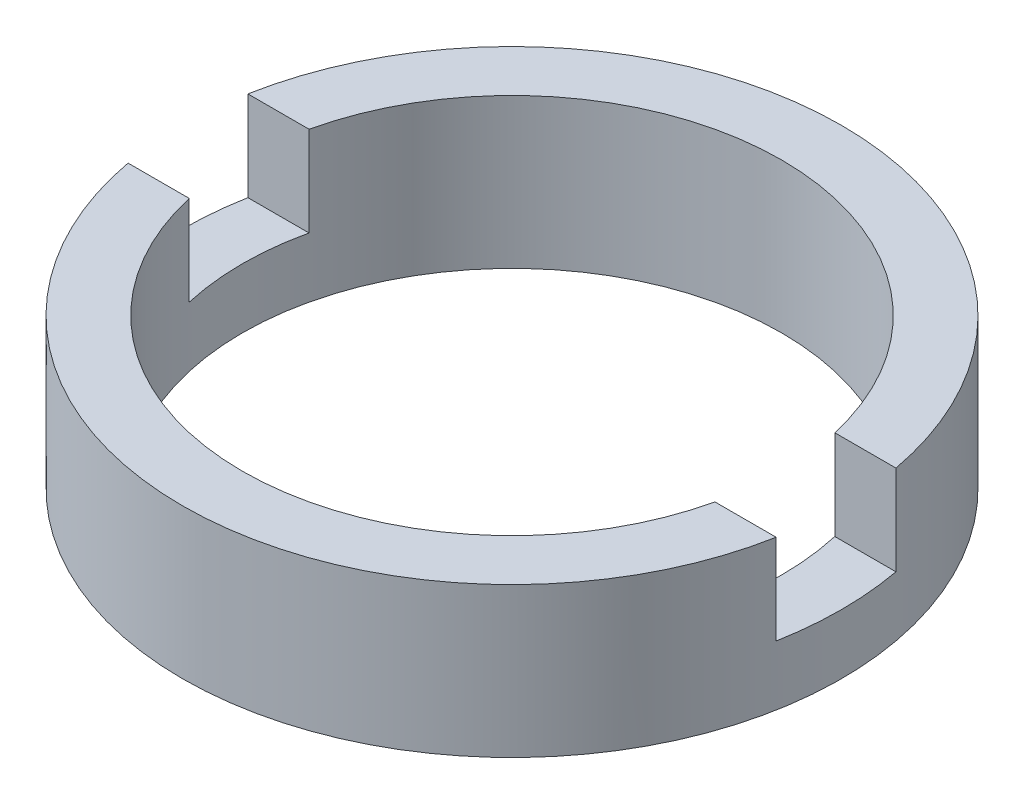
ISO-10303-21;
HEADER;
FILE_DESCRIPTION(('STEP AP214'),'2;1');
FILE_NAME('part.step','',(''),(''),'','','');
FILE_SCHEMA(('AUTOMOTIVE_DESIGN { 1 0 10303 214 1 1 1 1 }'));
ENDSEC;
DATA;
#1=APPLICATION_CONTEXT('core data for automotive mechanical design processes');
#2=APPLICATION_PROTOCOL_DEFINITION('international standard','automotive_design',2000,#1);
#3=PRODUCT_CONTEXT('',#1,'mechanical');
#4=PRODUCT('Part','Part','',(#3));
#5=PRODUCT_RELATED_PRODUCT_CATEGORY('part','',(#4));
#6=PRODUCT_DEFINITION_FORMATION('','',#4);
#7=PRODUCT_DEFINITION_CONTEXT('part definition',#1,'design');
#8=PRODUCT_DEFINITION('design','',#6,#7);
#9=PRODUCT_DEFINITION_SHAPE('','',#8);
#10=(LENGTH_UNIT() NAMED_UNIT(*) SI_UNIT(.MILLI.,.METRE.));
#11=(NAMED_UNIT(*) PLANE_ANGLE_UNIT() SI_UNIT($,.RADIAN.));
#12=(NAMED_UNIT(*) SI_UNIT($,.STERADIAN.) SOLID_ANGLE_UNIT());
#13=UNCERTAINTY_MEASURE_WITH_UNIT(LENGTH_MEASURE(1.E-05),#10,'distance_accuracy_value','');
#14=(GEOMETRIC_REPRESENTATION_CONTEXT(3) GLOBAL_UNCERTAINTY_ASSIGNED_CONTEXT((#13)) GLOBAL_UNIT_ASSIGNED_CONTEXT((#10,
#11,#12)) REPRESENTATION_CONTEXT('',''));
#15=CARTESIAN_POINT('',(0.,0.,0.));
#16=DIRECTION('',(0.,0.,1.));
#17=DIRECTION('',(1.,0.,0.));
#18=AXIS2_PLACEMENT_3D('',#15,#16,#17);
#19=CARTESIAN_POINT('',(4.50000000000001,-1.96424978717943,0.));
#20=DIRECTION('',(0.,-1.,0.));
#21=DIRECTION('',(0.,0.,-1.));
#22=AXIS2_PLACEMENT_3D('',#19,#20,#21);
#23=PLANE('',#22);
#24=CARTESIAN_POINT('',(0.,-1.96424978717943,0.));
#25=DIRECTION('',(0.,1.,0.));
#26=DIRECTION('',(0.,0.,1.));
#27=AXIS2_PLACEMENT_3D('',#24,#25,#26);
#28=CIRCLE('',#27,5.50000000000001);
#29=CARTESIAN_POINT('',(-5.408326913196,-1.96424978717943,1.));
#30=VERTEX_POINT('',#29);
#31=CARTESIAN_POINT('',(5.40832691319598,-1.96424978717943,1.));
#32=VERTEX_POINT('',#31);
#33=EDGE_CURVE('E129',#30,#32,#28,.T.);
#34=ORIENTED_EDGE('',*,*,#33,.T.);
#35=DIRECTION('',(1.,0.,0.));
#36=VECTOR('',#35,1.);
#37=CARTESIAN_POINT('',(-26.8525402726146,-1.96424978717943,1.));
#38=LINE('',#37,#36);
#39=CARTESIAN_POINT('',(4.38748219369607,-1.96424978717943,1.));
#40=VERTEX_POINT('',#39);
#41=EDGE_CURVE('E122',#40,#32,#38,.T.);
#42=ORIENTED_EDGE('',*,*,#41,.F.);
#43=CARTESIAN_POINT('',(0.,-1.96424978717943,0.));
#44=DIRECTION('',(0.,1.,0.));
#45=DIRECTION('',(0.,0.,1.));
#46=AXIS2_PLACEMENT_3D('',#43,#44,#45);
#47=CIRCLE('',#46,4.50000000000001);
#48=CARTESIAN_POINT('',(-4.38748219369607,-1.96424978717943,1.));
#49=VERTEX_POINT('',#48);
#50=EDGE_CURVE('E136',#49,#40,#47,.T.);
#51=ORIENTED_EDGE('',*,*,#50,.F.);
#52=EDGE_CURVE('E151',#30,#49,#38,.T.);
#53=ORIENTED_EDGE('',*,*,#52,.F.);
#54=EDGE_LOOP('',(#34,#42,#51,#53));
#55=FACE_BOUND('',#54,.T.);
#56=ADVANCED_FACE('F39',(#55),#23,.F.);
#57=CARTESIAN_POINT('',(0.,56.2608426270136,0.));
#58=DIRECTION('',(0.,1.,0.));
#59=DIRECTION('',(0.,0.,1.));
#60=AXIS2_PLACEMENT_3D('',#57,#58,#59);
#61=CYLINDRICAL_SURFACE('',#60,5.50000000000001);
#62=CARTESIAN_POINT('',(0.,-3.46424978717943,0.));
#63=DIRECTION('',(0.,1.,0.));
#64=DIRECTION('',(0.,0.,1.));
#65=AXIS2_PLACEMENT_3D('',#62,#63,#64);
#66=CIRCLE('',#65,5.50000000000001);
#67=CARTESIAN_POINT('',(5.40832691319599,-3.46424978717943,1.));
#68=VERTEX_POINT('',#67);
#69=CARTESIAN_POINT('',(5.40832691319599,-3.46424978717943,-1.));
#70=VERTEX_POINT('',#69);
#71=EDGE_CURVE('E112',#68,#70,#66,.T.);
#72=ORIENTED_EDGE('',*,*,#71,.F.);
#73=DIRECTION('',(0.,1.,0.));
#74=VECTOR('',#73,1.);
#75=CARTESIAN_POINT('',(5.40832691319599,56.2608426270136,1.));
#76=LINE('',#75,#74);
#77=EDGE_CURVE('E164',#68,#32,#76,.T.);
#78=ORIENTED_EDGE('',*,*,#77,.T.);
#79=ORIENTED_EDGE('',*,*,#33,.F.);
#80=DIRECTION('',(0.,1.,0.));
#81=VECTOR('',#80,1.);
#82=CARTESIAN_POINT('',(-5.40832691319599,56.2608426270136,1.));
#83=LINE('',#82,#81);
#84=CARTESIAN_POINT('',(-5.40832691319599,-3.46424978717943,1.));
#85=VERTEX_POINT('',#84);
#86=EDGE_CURVE('E161',#30,#85,#83,.F.);
#87=ORIENTED_EDGE('',*,*,#86,.T.);
#88=CARTESIAN_POINT('',(-5.40832691319599,-3.46424978717943,-1.));
#89=VERTEX_POINT('',#88);
#90=EDGE_CURVE('E158',#89,#85,#66,.T.);
#91=ORIENTED_EDGE('',*,*,#90,.F.);
#92=DIRECTION('',(0.,1.,0.));
#93=VECTOR('',#92,1.);
#94=CARTESIAN_POINT('',(-5.40832691319599,56.2608426270136,-1.));
#95=LINE('',#94,#93);
#96=CARTESIAN_POINT('',(-5.408326913196,-1.96424978717943,-1.));
#97=VERTEX_POINT('',#96);
#98=EDGE_CURVE('E111',#89,#97,#95,.T.);
#99=ORIENTED_EDGE('',*,*,#98,.T.);
#100=CARTESIAN_POINT('',(5.40832691319598,-1.96424978717943,-1.));
#101=VERTEX_POINT('',#100);
#102=EDGE_CURVE('E119',#101,#97,#28,.T.);
#103=ORIENTED_EDGE('',*,*,#102,.F.);
#104=DIRECTION('',(0.,1.,0.));
#105=VECTOR('',#104,1.);
#106=CARTESIAN_POINT('',(5.40832691319599,56.2608426270136,-1.));
#107=LINE('',#106,#105);
#108=EDGE_CURVE('E103',#101,#70,#107,.F.);
#109=ORIENTED_EDGE('',*,*,#108,.T.);
#110=EDGE_LOOP('',(#72,#78,#79,#87,#91,#99,#103,#109));
#111=FACE_BOUND('',#110,.T.);
#112=CARTESIAN_POINT('',(0.,-4.46424978717943,0.));
#113=DIRECTION('',(0.,1.,0.));
#114=DIRECTION('',(0.,0.,1.));
#115=AXIS2_PLACEMENT_3D('',#112,#113,#114);
#116=CIRCLE('',#115,5.50000000000001);
#117=CARTESIAN_POINT('',(0.,-4.46424978717943,5.50000000000001));
#118=VERTEX_POINT('',#117);
#119=EDGE_CURVE('E167',#118,#118,#116,.T.);
#120=ORIENTED_EDGE('',*,*,#119,.T.);
#121=EDGE_LOOP('',(#120));
#122=FACE_BOUND('',#121,.T.);
#123=ADVANCED_FACE('F41',(#111,#122),#61,.T.);
#124=ORIENTED_EDGE('',*,*,#102,.T.);
#125=DIRECTION('',(-1.,0.,0.));
#126=VECTOR('',#125,1.);
#127=CARTESIAN_POINT('',(-26.8525402726146,-1.96424978717943,-1.));
#128=LINE('',#127,#126);
#129=CARTESIAN_POINT('',(-4.38748219369607,-1.96424978717943,-1.));
#130=VERTEX_POINT('',#129);
#131=EDGE_CURVE('E123',#130,#97,#128,.T.);
#132=ORIENTED_EDGE('',*,*,#131,.F.);
#133=CARTESIAN_POINT('',(4.38748219369607,-1.96424978717943,-1.));
#134=VERTEX_POINT('',#133);
#135=EDGE_CURVE('E121',#134,#130,#47,.T.);
#136=ORIENTED_EDGE('',*,*,#135,.F.);
#137=EDGE_CURVE('E106',#101,#134,#128,.T.);
#138=ORIENTED_EDGE('',*,*,#137,.F.);
#139=EDGE_LOOP('',(#124,#132,#136,#138));
#140=FACE_BOUND('',#139,.T.);
#141=ADVANCED_FACE('F117',(#140),#23,.F.);
#142=CARTESIAN_POINT('',(0.,56.2608426270136,0.));
#143=DIRECTION('',(0.,1.,0.));
#144=DIRECTION('',(0.,0.,1.));
#145=AXIS2_PLACEMENT_3D('',#142,#143,#144);
#146=CYLINDRICAL_SURFACE('',#145,4.50000000000001);
#147=CARTESIAN_POINT('',(0.,-3.46424978717943,0.));
#148=DIRECTION('',(0.,1.,0.));
#149=DIRECTION('',(0.,0.,1.));
#150=AXIS2_PLACEMENT_3D('',#147,#148,#149);
#151=CIRCLE('',#150,4.50000000000001);
#152=CARTESIAN_POINT('',(-4.38748219369607,-3.46424978717943,1.));
#153=VERTEX_POINT('',#152);
#154=CARTESIAN_POINT('',(-4.38748219369607,-3.46424978717943,-1.));
#155=VERTEX_POINT('',#154);
#156=EDGE_CURVE('E133',#153,#155,#151,.F.);
#157=ORIENTED_EDGE('',*,*,#156,.F.);
#158=DIRECTION('',(0.,1.,0.));
#159=VECTOR('',#158,1.);
#160=CARTESIAN_POINT('',(-4.38748219369607,56.2608426270136,1.));
#161=LINE('',#160,#159);
#162=EDGE_CURVE('E11',#153,#49,#161,.T.);
#163=ORIENTED_EDGE('',*,*,#162,.T.);
#164=ORIENTED_EDGE('',*,*,#50,.T.);
#165=DIRECTION('',(0.,1.,0.));
#166=VECTOR('',#165,1.);
#167=CARTESIAN_POINT('',(4.38748219369607,56.2608426270136,1.));
#168=LINE('',#167,#166);
#169=CARTESIAN_POINT('',(4.38748219369607,-3.46424978717943,1.));
#170=VERTEX_POINT('',#169);
#171=EDGE_CURVE('E140',#40,#170,#168,.F.);
#172=ORIENTED_EDGE('',*,*,#171,.T.);
#173=CARTESIAN_POINT('',(4.38748219369607,-3.46424978717943,-1.));
#174=VERTEX_POINT('',#173);
#175=EDGE_CURVE('E128',#174,#170,#151,.F.);
#176=ORIENTED_EDGE('',*,*,#175,.F.);
#177=DIRECTION('',(0.,1.,0.));
#178=VECTOR('',#177,1.);
#179=CARTESIAN_POINT('',(4.38748219369607,56.2608426270136,-1.));
#180=LINE('',#179,#178);
#181=EDGE_CURVE('E131',#174,#134,#180,.T.);
#182=ORIENTED_EDGE('',*,*,#181,.T.);
#183=ORIENTED_EDGE('',*,*,#135,.T.);
#184=DIRECTION('',(0.,1.,0.));
#185=VECTOR('',#184,1.);
#186=CARTESIAN_POINT('',(-4.38748219369607,56.2608426270136,-1.));
#187=LINE('',#186,#185);
#188=EDGE_CURVE('E47',#130,#155,#187,.F.);
#189=ORIENTED_EDGE('',*,*,#188,.T.);
#190=EDGE_LOOP('',(#157,#163,#164,#172,#176,#182,#183,#189));
#191=FACE_BOUND('',#190,.T.);
#192=CARTESIAN_POINT('',(0.,-4.46424978717943,0.));
#193=DIRECTION('',(0.,1.,0.));
#194=DIRECTION('',(0.,0.,1.));
#195=AXIS2_PLACEMENT_3D('',#192,#193,#194);
#196=CIRCLE('',#195,4.50000000000001);
#197=CARTESIAN_POINT('',(0.,-4.46424978717943,4.50000000000001));
#198=VERTEX_POINT('',#197);
#199=EDGE_CURVE('E169',#198,#198,#196,.T.);
#200=ORIENTED_EDGE('',*,*,#199,.F.);
#201=EDGE_LOOP('',(#200));
#202=FACE_BOUND('',#201,.T.);
#203=ADVANCED_FACE('F175',(#191,#202),#146,.F.);
#204=CARTESIAN_POINT('',(4.50000000000001,-4.46424978717943,0.));
#205=DIRECTION('',(0.,1.,0.));
#206=DIRECTION('',(0.,0.,1.));
#207=AXIS2_PLACEMENT_3D('',#204,#205,#206);
#208=PLANE('',#207);
#209=ORIENTED_EDGE('',*,*,#119,.F.);
#210=EDGE_LOOP('',(#209));
#211=FACE_BOUND('',#210,.T.);
#212=ORIENTED_EDGE('',*,*,#199,.T.);
#213=EDGE_LOOP('',(#212));
#214=FACE_BOUND('',#213,.T.);
#215=ADVANCED_FACE('F205',(#211,#214),#208,.F.);
#216=CARTESIAN_POINT('',(0.,-3.46424978717943,0.));
#217=DIRECTION('',(0.,1.,0.));
#218=DIRECTION('',(0.,0.,1.));
#219=AXIS2_PLACEMENT_3D('',#216,#217,#218);
#220=PLANE('',#219);
#221=ORIENTED_EDGE('',*,*,#71,.T.);
#222=DIRECTION('',(-1.,0.,0.));
#223=VECTOR('',#222,1.);
#224=CARTESIAN_POINT('',(-26.8525402726146,-3.46424978717943,-1.));
#225=LINE('',#224,#223);
#226=EDGE_CURVE('E62',#70,#174,#225,.T.);
#227=ORIENTED_EDGE('',*,*,#226,.T.);
#228=ORIENTED_EDGE('',*,*,#175,.T.);
#229=DIRECTION('',(1.,0.,0.));
#230=VECTOR('',#229,1.);
#231=CARTESIAN_POINT('',(-26.8525402726146,-3.46424978717943,1.));
#232=LINE('',#231,#230);
#233=EDGE_CURVE('E153',#170,#68,#232,.T.);
#234=ORIENTED_EDGE('',*,*,#233,.T.);
#235=EDGE_LOOP('',(#221,#227,#228,#234));
#236=FACE_BOUND('',#235,.T.);
#237=ADVANCED_FACE('F179',(#236),#220,.T.);
#238=CARTESIAN_POINT('',(-26.8525402726146,-3.46424978717943,-1.));
#239=DIRECTION('',(0.,0.,-1.));
#240=DIRECTION('',(-1.,0.,0.));
#241=AXIS2_PLACEMENT_3D('',#238,#239,#240);
#242=PLANE('',#241);
#243=ORIENTED_EDGE('',*,*,#137,.T.);
#244=ORIENTED_EDGE('',*,*,#181,.F.);
#245=ORIENTED_EDGE('',*,*,#226,.F.);
#246=ORIENTED_EDGE('',*,*,#108,.F.);
#247=EDGE_LOOP('',(#243,#244,#245,#246));
#248=FACE_BOUND('',#247,.T.);
#249=ADVANCED_FACE('F105',(#248),#242,.F.);
#250=CARTESIAN_POINT('',(-26.8525402726146,-3.46424978717943,1.));
#251=DIRECTION('',(0.,0.,1.));
#252=DIRECTION('',(1.,0.,0.));
#253=AXIS2_PLACEMENT_3D('',#250,#251,#252);
#254=PLANE('',#253);
#255=ORIENTED_EDGE('',*,*,#233,.F.);
#256=ORIENTED_EDGE('',*,*,#171,.F.);
#257=ORIENTED_EDGE('',*,*,#41,.T.);
#258=ORIENTED_EDGE('',*,*,#77,.F.);
#259=EDGE_LOOP('',(#255,#256,#257,#258));
#260=FACE_BOUND('',#259,.T.);
#261=ADVANCED_FACE('F181',(#260),#254,.F.);
#262=ORIENTED_EDGE('',*,*,#52,.T.);
#263=ORIENTED_EDGE('',*,*,#162,.F.);
#264=EDGE_CURVE('E54',#85,#153,#232,.T.);
#265=ORIENTED_EDGE('',*,*,#264,.F.);
#266=ORIENTED_EDGE('',*,*,#86,.F.);
#267=EDGE_LOOP('',(#262,#263,#265,#266));
#268=FACE_BOUND('',#267,.T.);
#269=ADVANCED_FACE('F187',(#268),#254,.F.);
#270=EDGE_CURVE('E148',#155,#89,#225,.T.);
#271=ORIENTED_EDGE('',*,*,#270,.F.);
#272=ORIENTED_EDGE('',*,*,#188,.F.);
#273=ORIENTED_EDGE('',*,*,#131,.T.);
#274=ORIENTED_EDGE('',*,*,#98,.F.);
#275=EDGE_LOOP('',(#271,#272,#273,#274));
#276=FACE_BOUND('',#275,.T.);
#277=ADVANCED_FACE('F150',(#276),#242,.F.);
#278=ORIENTED_EDGE('',*,*,#90,.T.);
#279=ORIENTED_EDGE('',*,*,#264,.T.);
#280=ORIENTED_EDGE('',*,*,#156,.T.);
#281=ORIENTED_EDGE('',*,*,#270,.T.);
#282=EDGE_LOOP('',(#278,#279,#280,#281));
#283=FACE_BOUND('',#282,.T.);
#284=ADVANCED_FACE('F147',(#283),#220,.T.);
#285=CLOSED_SHELL('',(#56,#123,#141,#203,#215,#237,#249,#261,#269,#277,#284));
#286=MANIFOLD_SOLID_BREP('B2',#285);
#287=ADVANCED_BREP_SHAPE_REPRESENTATION('',(#18,#286),#14);
#288=SHAPE_DEFINITION_REPRESENTATION(#9,#287);
ENDSEC;
END-ISO-10303-21;
